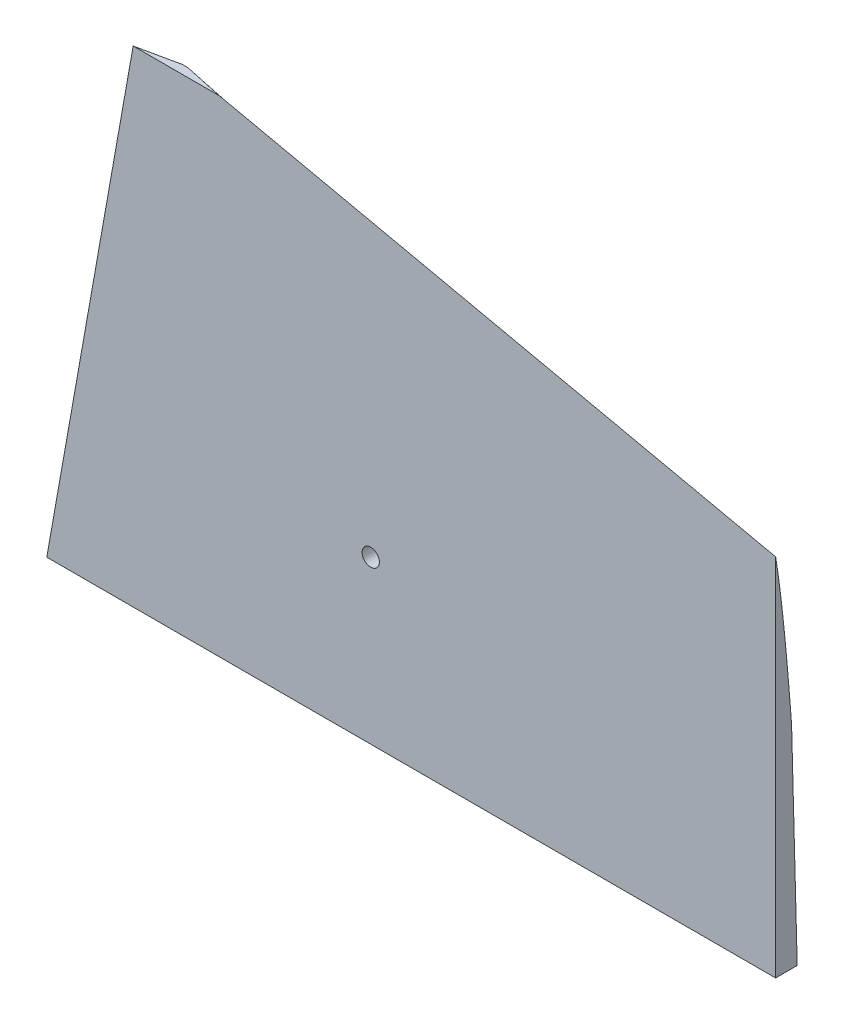
ISO-10303-21;
HEADER;
FILE_DESCRIPTION(('STEP AP214'),'2;1');
FILE_NAME('part.step','',(''),(''),'','','');
FILE_SCHEMA(('AUTOMOTIVE_DESIGN { 1 0 10303 214 1 1 1 1 }'));
ENDSEC;
DATA;
#1=APPLICATION_CONTEXT('core data for automotive mechanical design processes');
#2=APPLICATION_PROTOCOL_DEFINITION('international standard','automotive_design',2000,#1);
#3=PRODUCT_CONTEXT('',#1,'mechanical');
#4=PRODUCT('Part','Part','',(#3));
#5=PRODUCT_RELATED_PRODUCT_CATEGORY('part','',(#4));
#6=PRODUCT_DEFINITION_FORMATION('','',#4);
#7=PRODUCT_DEFINITION_CONTEXT('part definition',#1,'design');
#8=PRODUCT_DEFINITION('design','',#6,#7);
#9=PRODUCT_DEFINITION_SHAPE('','',#8);
#10=(LENGTH_UNIT() NAMED_UNIT(*) SI_UNIT(.MILLI.,.METRE.));
#11=(NAMED_UNIT(*) PLANE_ANGLE_UNIT() SI_UNIT($,.RADIAN.));
#12=(NAMED_UNIT(*) SI_UNIT($,.STERADIAN.) SOLID_ANGLE_UNIT());
#13=UNCERTAINTY_MEASURE_WITH_UNIT(LENGTH_MEASURE(1.E-05),#10,'distance_accuracy_value','');
#14=(GEOMETRIC_REPRESENTATION_CONTEXT(3) GLOBAL_UNCERTAINTY_ASSIGNED_CONTEXT((#13)) GLOBAL_UNIT_ASSIGNED_CONTEXT((#10,
#11,#12)) REPRESENTATION_CONTEXT('',''));
#15=CARTESIAN_POINT('',(0.,0.,0.));
#16=DIRECTION('',(0.,0.,1.));
#17=DIRECTION('',(1.,0.,0.));
#18=AXIS2_PLACEMENT_3D('',#15,#16,#17);
#19=CARTESIAN_POINT('',(0.,0.,0.));
#20=DIRECTION('',(0.,1.,0.));
#21=DIRECTION('',(0.,0.,-1.));
#22=AXIS2_PLACEMENT_3D('',#19,#20,#21);
#23=PLANE('',#22);
#24=DIRECTION('',(1.,0.,0.));
#25=VECTOR('',#24,1.);
#26=CARTESIAN_POINT('',(220.,0.,-4.));
#27=LINE('',#26,#25);
#28=CARTESIAN_POINT('',(43.,0.,-4.));
#29=VERTEX_POINT('',#28);
#30=CARTESIAN_POINT('',(135.,0.,-4.));
#31=VERTEX_POINT('',#30);
#32=EDGE_CURVE('E46',#29,#31,#27,.T.);
#33=ORIENTED_EDGE('',*,*,#32,.T.);
#34=DIRECTION('',(0.,0.,-1.));
#35=VECTOR('',#34,1.);
#36=CARTESIAN_POINT('',(135.,0.,572.534712044283));
#37=LINE('',#36,#35);
#38=CARTESIAN_POINT('',(135.,0.,0.));
#39=VERTEX_POINT('',#38);
#40=EDGE_CURVE('E54',#39,#31,#37,.T.);
#41=ORIENTED_EDGE('',*,*,#40,.F.);
#42=DIRECTION('',(-1.,0.,0.));
#43=VECTOR('',#42,1.);
#44=CARTESIAN_POINT('',(0.,0.,0.));
#45=LINE('',#44,#43);
#46=CARTESIAN_POINT('',(0.,0.,0.));
#47=VERTEX_POINT('',#46);
#48=EDGE_CURVE('E40',#39,#47,#45,.T.);
#49=ORIENTED_EDGE('',*,*,#48,.T.);
#50=DIRECTION('',(0.995701215992102,0.,-0.0926233689294979));
#51=VECTOR('',#50,1.);
#52=CARTESIAN_POINT('',(43.,0.,-4.));
#53=LINE('',#52,#51);
#54=EDGE_CURVE('E161',#47,#29,#53,.T.);
#55=ORIENTED_EDGE('',*,*,#54,.T.);
#56=EDGE_LOOP('',(#33,#41,#49,#55));
#57=FACE_BOUND('',#56,.T.);
#58=ADVANCED_FACE('F36',(#57),#23,.F.);
#59=CARTESIAN_POINT('',(0.,90.,0.));
#60=DIRECTION('',(0.,1.,0.));
#61=DIRECTION('',(0.,0.,-1.));
#62=AXIS2_PLACEMENT_3D('',#59,#60,#61);
#63=PLANE('',#62);
#64=DIRECTION('',(0.977992836424307,0.,-0.208638471770519));
#65=VECTOR('',#64,1.);
#66=CARTESIAN_POINT('',(23.5,90.,-1.6));
#67=LINE('',#66,#65);
#68=CARTESIAN_POINT('',(16.,90.,0.));
#69=VERTEX_POINT('',#68);
#70=CARTESIAN_POINT('',(23.5,90.,-1.6));
#71=VERTEX_POINT('',#70);
#72=EDGE_CURVE('E120',#69,#71,#67,.T.);
#73=ORIENTED_EDGE('',*,*,#72,.F.);
#74=DIRECTION('',(-1.,0.,0.));
#75=VECTOR('',#74,1.);
#76=CARTESIAN_POINT('',(16.,90.,0.));
#77=LINE('',#76,#75);
#78=CARTESIAN_POINT('',(32.,90.,0.));
#79=VERTEX_POINT('',#78);
#80=EDGE_CURVE('E204',#79,#69,#77,.T.);
#81=ORIENTED_EDGE('',*,*,#80,.F.);
#82=DIRECTION('',(0.977992836424307,0.,0.208638471770519));
#83=VECTOR('',#82,1.);
#84=CARTESIAN_POINT('',(32.,90.,0.));
#85=LINE('',#84,#83);
#86=CARTESIAN_POINT('',(24.5,90.,-1.6));
#87=VERTEX_POINT('',#86);
#88=EDGE_CURVE('E91',#87,#79,#85,.T.);
#89=ORIENTED_EDGE('',*,*,#88,.F.);
#90=DIRECTION('',(1.,0.,0.));
#91=VECTOR('',#90,1.);
#92=CARTESIAN_POINT('',(24.5,90.,-1.6));
#93=LINE('',#92,#91);
#94=EDGE_CURVE('E124',#71,#87,#93,.T.);
#95=ORIENTED_EDGE('',*,*,#94,.F.);
#96=EDGE_LOOP('',(#73,#81,#89,#95));
#97=FACE_BOUND('',#96,.T.);
#98=ADVANCED_FACE('F179',(#97),#63,.T.);
#99=CARTESIAN_POINT('',(23.5,90.,-1.6));
#100=CARTESIAN_POINT('',(43.,0.,-4.));
#101=CARTESIAN_POINT('',(22.25,90.,-1.33333333333334));
#102=CARTESIAN_POINT('',(35.8333333333333,0.,-3.33333333333333));
#103=CARTESIAN_POINT('',(21.,90.,-1.06666666666667));
#104=CARTESIAN_POINT('',(28.6666666666667,0.,-2.66666666666667));
#105=CARTESIAN_POINT('',(18.5,90.,-0.533333333333336));
#106=CARTESIAN_POINT('',(14.3333333333333,0.,-1.33333333333333));
#107=CARTESIAN_POINT('',(17.25,90.,-0.266666666666668));
#108=CARTESIAN_POINT('',(7.16666666666666,0.,-0.666666666666667));
#109=CARTESIAN_POINT('',(16.,90.,0.));
#110=CARTESIAN_POINT('',(0.,0.,0.));
#111=B_SPLINE_SURFACE_WITH_KNOTS('',3,1,((#99,#100),(#101,#102),(#103,#104),(#105,#106),(#107,
#108),(#109,#110)),.UNSPECIFIED.,.F.,.F.,.F.,(4,2,4),(2,2),(0.,0.5,1.),(0.,1.),.UNSPECIFIED.);
#112=DIRECTION('',(-0.211681469508544,0.976991397731741,0.0260531039395131));
#113=VECTOR('',#112,1.);
#114=CARTESIAN_POINT('',(33.25,45.,-2.8));
#115=LINE('',#114,#113);
#116=EDGE_CURVE('E129',#29,#71,#115,.T.);
#117=DIRECTION('',(-0.175033334717495,-0.984562507785907,0.));
#118=VECTOR('',#117,1.);
#119=CARTESIAN_POINT('',(7.99999999999999,45.,0.));
#120=LINE('',#119,#118);
#121=EDGE_CURVE('E97',#69,#47,#120,.T.);
#122=ORIENTED_EDGE('',*,*,#72,.T.);
#123=ORIENTED_EDGE('',*,*,#116,.F.);
#124=ORIENTED_EDGE('',*,*,#54,.F.);
#125=ORIENTED_EDGE('',*,*,#121,.F.);
#126=EDGE_LOOP('',(#122,#123,#124,#125));
#127=FACE_BOUND('',#126,.T.);
#128=ADVANCED_FACE('F168',(#127),#111,.F.);
#129=CARTESIAN_POINT('',(0.,0.,0.));
#130=DIRECTION('',(0.,0.,1.));
#131=DIRECTION('',(-1.,0.,0.));
#132=AXIS2_PLACEMENT_3D('',#129,#130,#131);
#133=PLANE('',#132);
#134=DIRECTION('',(0.,-1.,0.));
#135=VECTOR('',#134,1.);
#136=CARTESIAN_POINT('',(135.,0.,0.));
#137=LINE('',#136,#135);
#138=CARTESIAN_POINT('',(135.,67.5544794188862,0.));
#139=VERTEX_POINT('',#138);
#140=EDGE_CURVE('E100',#139,#39,#137,.T.);
#141=ORIENTED_EDGE('',*,*,#140,.F.);
#142=DIRECTION('',(0.977069481239197,-0.212920710197404,0.));
#143=VECTOR('',#142,1.);
#144=CARTESIAN_POINT('',(32.,90.,0.));
#145=LINE('',#144,#143);
#146=EDGE_CURVE('E87',#79,#139,#145,.T.);
#147=ORIENTED_EDGE('',*,*,#146,.F.);
#148=ORIENTED_EDGE('',*,*,#80,.T.);
#149=ORIENTED_EDGE('',*,*,#121,.T.);
#150=ORIENTED_EDGE('',*,*,#48,.F.);
#151=EDGE_LOOP('',(#141,#147,#148,#149,#150));
#152=FACE_BOUND('',#151,.T.);
#153=CARTESIAN_POINT('',(60.,30.,0.));
#154=DIRECTION('',(0.,0.,-1.));
#155=DIRECTION('',(-1.,0.,0.));
#156=AXIS2_PLACEMENT_3D('',#153,#154,#155);
#157=CIRCLE('',#156,1.6);
#158=CARTESIAN_POINT('',(58.4,30.,0.));
#159=VERTEX_POINT('',#158);
#160=EDGE_CURVE('E117',#159,#159,#157,.T.);
#161=ORIENTED_EDGE('',*,*,#160,.T.);
#162=EDGE_LOOP('',(#161));
#163=FACE_BOUND('',#162,.T.);
#164=ADVANCED_FACE('F101',(#152,#163),#133,.T.);
#165=CARTESIAN_POINT('',(0.,0.10659086871558,-3.99715757683425));
#166=DIRECTION('',(0.,0.0266571902389806,-0.999644633961771));
#167=DIRECTION('',(0.,-0.999644633961771,-0.0266571902389806));
#168=AXIS2_PLACEMENT_3D('',#165,#166,#167);
#169=PLANE('',#168);
#170=DIRECTION('',(0.,0.999644633961771,0.0266571902389806));
#171=VECTOR('',#170,1.);
#172=CARTESIAN_POINT('',(135.,0.10659086871558,-3.99715757683425));
#173=LINE('',#172,#171);
#174=CARTESIAN_POINT('',(135.,39.1304347826087,-2.95652173913043));
#175=VERTEX_POINT('',#174);
#176=EDGE_CURVE('E62',#31,#175,#173,.T.);
#177=ORIENTED_EDGE('',*,*,#176,.F.);
#178=ORIENTED_EDGE('',*,*,#32,.F.);
#179=ORIENTED_EDGE('',*,*,#116,.T.);
#180=ORIENTED_EDGE('',*,*,#94,.T.);
#181=DIRECTION('',(0.908310455683333,-0.41814803586445,-0.0111506142897187));
#182=VECTOR('',#181,1.);
#183=CARTESIAN_POINT('',(122.25,45.,-2.8));
#184=LINE('',#183,#182);
#185=EDGE_CURVE('E96',#87,#175,#184,.T.);
#186=ORIENTED_EDGE('',*,*,#185,.T.);
#187=EDGE_LOOP('',(#177,#178,#179,#180,#186));
#188=FACE_BOUND('',#187,.T.);
#189=CARTESIAN_POINT('',(60.,30.,-3.2));
#190=DIRECTION('',(0.,-0.0266571902389806,0.999644633961771));
#191=DIRECTION('',(0.,-0.999644633961771,-0.0266571902389806));
#192=AXIS2_PLACEMENT_3D('',#189,#190,#191);
#193=ELLIPSE('',#192,1.60056878778903,1.6);
#194=CARTESIAN_POINT('',(60.,28.4,-3.24266666666667));
#195=VERTEX_POINT('',#194);
#196=EDGE_CURVE('E106',#195,#195,#193,.T.);
#197=ORIENTED_EDGE('',*,*,#196,.T.);
#198=EDGE_LOOP('',(#197));
#199=FACE_BOUND('',#198,.T.);
#200=ADVANCED_FACE('F131',(#188,#199),#169,.T.);
#201=CARTESIAN_POINT('',(32.,90.,0.));
#202=CARTESIAN_POINT('',(445.,0.,0.));
#203=CARTESIAN_POINT('',(30.75,90.,-0.266666666666667));
#204=CARTESIAN_POINT('',(407.5,0.,-0.666666666666668));
#205=CARTESIAN_POINT('',(29.5,90.,-0.533333333333334));
#206=CARTESIAN_POINT('',(370.,0.,-1.33333333333333));
#207=CARTESIAN_POINT('',(27.,90.,-1.06666666666667));
#208=CARTESIAN_POINT('',(295.,0.,-2.66666666666667));
#209=CARTESIAN_POINT('',(25.75,90.,-1.33333333333333));
#210=CARTESIAN_POINT('',(257.5,0.,-3.33333333333333));
#211=CARTESIAN_POINT('',(24.5,90.,-1.6));
#212=CARTESIAN_POINT('',(220.,0.,-4.));
#213=B_SPLINE_SURFACE_WITH_KNOTS('',3,1,((#201,#202),(#203,#204),(#205,#206),(#207,#208),(#209,
#210),(#211,#212)),.UNSPECIFIED.,.F.,.F.,.F.,(4,2,4),(2,2),(0.,0.5,1.),(0.,1.),.UNSPECIFIED.);
#214=CARTESIAN_POINT('',(135.,39.1304347826087,-2.95652173913043));
#215=CARTESIAN_POINT('',(135.,39.7238609286217,-2.91147673999861));
#216=CARTESIAN_POINT('',(135.,40.3172500147002,-2.86594377892562));
#217=CARTESIAN_POINT('',(135.,41.5039443931288,-2.77378951553559));
#218=CARTESIAN_POINT('',(135.,42.0972496853715,-2.72716821183773));
#219=CARTESIAN_POINT('',(135.,43.8770344864516,-2.58550242725523));
#220=CARTESIAN_POINT('',(135.,45.0633715313259,-2.48865693298772));
#221=CARTESIAN_POINT('',(135.,47.4355537274144,-2.28900277625913));
#222=CARTESIAN_POINT('',(135.,48.6213988753919,-2.18619407516782));
#223=CARTESIAN_POINT('',(135.,50.9924184015016,-1.9730367571411));
#224=CARTESIAN_POINT('',(135.,52.1775927772679,-1.86268811377631));
#225=CARTESIAN_POINT('',(135.,54.5480223311345,-1.63219390453586));
#226=CARTESIAN_POINT('',(135.,55.7332767120178,-1.512040043399));
#227=CARTESIAN_POINT('',(135.,57.5101246736208,-1.32217225358098));
#228=CARTESIAN_POINT('',(135.,58.1022335583581,-1.25727700081682));
#229=CARTESIAN_POINT('',(135.,59.2860281338278,-1.12374255974588));
#230=CARTESIAN_POINT('',(135.,59.8777138262208,-1.05510338621222));
#231=CARTESIAN_POINT('',(135.,61.0609525011428,-0.913409744372866));
#232=CARTESIAN_POINT('',(135.,61.6525051409613,-0.840352404277453));
#233=CARTESIAN_POINT('',(135.,62.8349432126549,-0.689085856168005));
#234=CARTESIAN_POINT('',(135.,63.4258286556403,-0.610876735268561));
#235=CARTESIAN_POINT('',(135.,64.6069936648889,-0.448308233052979));
#236=CARTESIAN_POINT('',(135.,65.1972729049079,-0.363946464582245));
#237=CARTESIAN_POINT('',(135.,66.0818833500138,-0.231890102538901));
#238=CARTESIAN_POINT('',(135.,66.3766266412987,-0.186951086925141));
#239=CARTESIAN_POINT('',(135.,66.9657995007422,-0.0950445389929136));
#240=CARTESIAN_POINT('',(135.,67.2602290658198,-0.0480769869373785));
#241=CARTESIAN_POINT('',(135.,67.5544794188862,0.));
#242=B_SPLINE_CURVE_WITH_KNOTS('',3,(#214,#215,#216,#217,#218,#219,#220,#221,#222,#223,#224,
#225,#226,#227,#228,#229,#230,#231,#232,#233,#234,#235,#236,#237,#238,#239,#240,#241),
.UNSPECIFIED.,.F.,.F.,(4,2,2,2,2,2,2,2,2,2,2,2,2,4),(0.,1.78539953853027,3.57080134241505,
7.14163921220265,10.7125002168055,14.2833737388099,17.8573001941754,19.6442543550313,
21.4312014652607,23.2193228348609,25.0074139757888,26.7962026040037,27.690644803456,
28.5850957075311),.UNSPECIFIED.);
#243=EDGE_CURVE('E11',#175,#139,#242,.T.);
#244=ORIENTED_EDGE('',*,*,#243,.F.);
#245=ORIENTED_EDGE('',*,*,#185,.F.);
#246=ORIENTED_EDGE('',*,*,#88,.T.);
#247=ORIENTED_EDGE('',*,*,#146,.T.);
#248=EDGE_LOOP('',(#244,#245,#246,#247));
#249=FACE_BOUND('',#248,.T.);
#250=ADVANCED_FACE('F89',(#249),#213,.F.);
#251=CARTESIAN_POINT('',(60.,30.,0.000100000000002602));
#252=DIRECTION('',(0.,0.,-1.));
#253=DIRECTION('',(1.,0.,0.));
#254=AXIS2_PLACEMENT_3D('',#251,#252,#253);
#255=CYLINDRICAL_SURFACE('',#254,1.6);
#256=ORIENTED_EDGE('',*,*,#160,.F.);
#257=EDGE_LOOP('',(#256));
#258=FACE_BOUND('',#257,.T.);
#259=ORIENTED_EDGE('',*,*,#196,.F.);
#260=EDGE_LOOP('',(#259));
#261=FACE_BOUND('',#260,.T.);
#262=ADVANCED_FACE('F271',(#258,#261),#255,.F.);
#263=CARTESIAN_POINT('',(135.,0.,572.534712044283));
#264=DIRECTION('',(-1.,0.,0.));
#265=DIRECTION('',(0.,0.,1.));
#266=AXIS2_PLACEMENT_3D('',#263,#264,#265);
#267=PLANE('',#266);
#268=ORIENTED_EDGE('',*,*,#243,.T.);
#269=ORIENTED_EDGE('',*,*,#140,.T.);
#270=ORIENTED_EDGE('',*,*,#40,.T.);
#271=ORIENTED_EDGE('',*,*,#176,.T.);
#272=EDGE_LOOP('',(#268,#269,#270,#271));
#273=FACE_BOUND('',#272,.T.);
#274=ADVANCED_FACE('F108',(#273),#267,.F.);
#275=CLOSED_SHELL('',(#58,#98,#128,#164,#200,#250,#262,#274));
#276=MANIFOLD_SOLID_BREP('B2',#275);
#277=ADVANCED_BREP_SHAPE_REPRESENTATION('',(#18,#276),#14);
#278=SHAPE_DEFINITION_REPRESENTATION(#9,#277);
ENDSEC;
END-ISO-10303-21;
